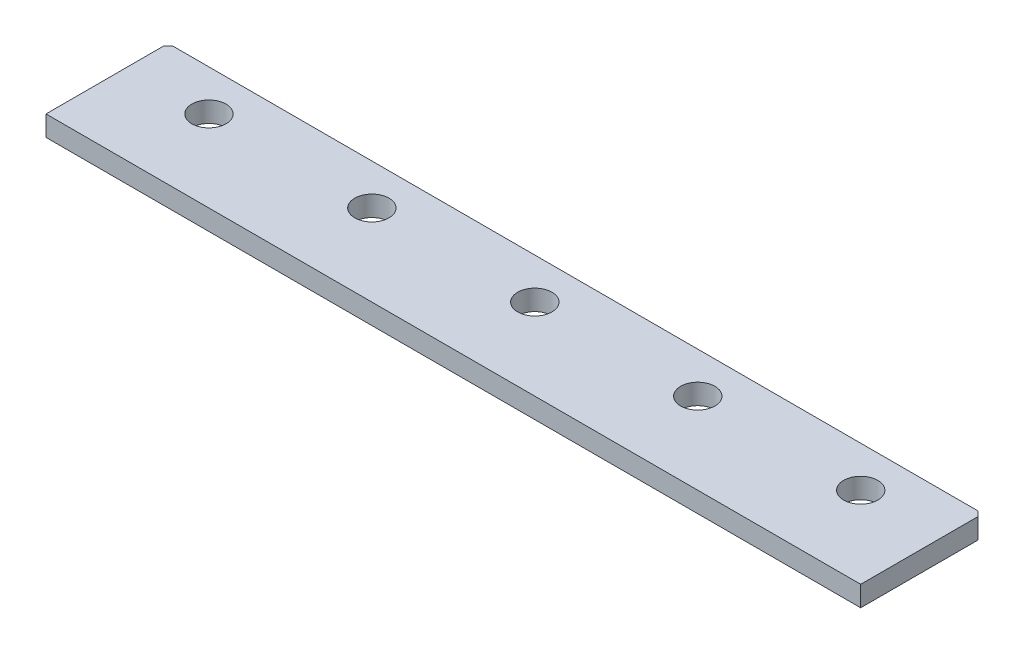
ISO-10303-21;
HEADER;
FILE_DESCRIPTION(('STEP AP214'),'2;1');
FILE_NAME('part.step','',(''),(''),'','','');
FILE_SCHEMA(('AUTOMOTIVE_DESIGN { 1 0 10303 214 1 1 1 1 }'));
ENDSEC;
DATA;
#1=APPLICATION_CONTEXT('core data for automotive mechanical design processes');
#2=APPLICATION_PROTOCOL_DEFINITION('international standard','automotive_design',2000,#1);
#3=PRODUCT_CONTEXT('',#1,'mechanical');
#4=PRODUCT('Part','Part','',(#3));
#5=PRODUCT_RELATED_PRODUCT_CATEGORY('part','',(#4));
#6=PRODUCT_DEFINITION_FORMATION('','',#4);
#7=PRODUCT_DEFINITION_CONTEXT('part definition',#1,'design');
#8=PRODUCT_DEFINITION('design','',#6,#7);
#9=PRODUCT_DEFINITION_SHAPE('','',#8);
#10=(LENGTH_UNIT() NAMED_UNIT(*) SI_UNIT(.MILLI.,.METRE.));
#11=(NAMED_UNIT(*) PLANE_ANGLE_UNIT() SI_UNIT($,.RADIAN.));
#12=(NAMED_UNIT(*) SI_UNIT($,.STERADIAN.) SOLID_ANGLE_UNIT());
#13=UNCERTAINTY_MEASURE_WITH_UNIT(LENGTH_MEASURE(1.E-05),#10,'distance_accuracy_value','');
#14=(GEOMETRIC_REPRESENTATION_CONTEXT(3) GLOBAL_UNCERTAINTY_ASSIGNED_CONTEXT((#13)) GLOBAL_UNIT_ASSIGNED_CONTEXT((#10,
#11,#12)) REPRESENTATION_CONTEXT('',''));
#15=CARTESIAN_POINT('',(0.,0.,0.));
#16=DIRECTION('',(0.,0.,1.));
#17=DIRECTION('',(1.,0.,0.));
#18=AXIS2_PLACEMENT_3D('',#15,#16,#17);
#19=CARTESIAN_POINT('',(-63.5,3.175,9.52500000000001));
#20=DIRECTION('',(1.,0.,0.));
#21=DIRECTION('',(0.,0.,-1.));
#22=AXIS2_PLACEMENT_3D('',#19,#20,#21);
#23=PLANE('',#22);
#24=DIRECTION('',(0.,0.,1.));
#25=VECTOR('',#24,1.);
#26=CARTESIAN_POINT('',(-63.5,3.175,9.52500000000001));
#27=LINE('',#26,#25);
#28=CARTESIAN_POINT('',(-63.5,3.175,-8.76299999999999));
#29=VERTEX_POINT('',#28);
#30=CARTESIAN_POINT('',(-63.5,3.175,9.52500000000001));
#31=VERTEX_POINT('',#30);
#32=EDGE_CURVE('E106',#29,#31,#27,.T.);
#33=ORIENTED_EDGE('',*,*,#32,.F.);
#34=DIRECTION('',(0.,1.,0.));
#35=VECTOR('',#34,1.);
#36=CARTESIAN_POINT('',(-63.5,0.,-8.76299999999999));
#37=LINE('',#36,#35);
#38=CARTESIAN_POINT('',(-63.5,0.,-8.76299999999999));
#39=VERTEX_POINT('',#38);
#40=EDGE_CURVE('E92',#39,#29,#37,.T.);
#41=ORIENTED_EDGE('',*,*,#40,.F.);
#42=DIRECTION('',(0.,0.,1.));
#43=VECTOR('',#42,1.);
#44=CARTESIAN_POINT('',(-63.5,0.,9.52500000000001));
#45=LINE('',#44,#43);
#46=CARTESIAN_POINT('',(-63.5,0.,9.52500000000001));
#47=VERTEX_POINT('',#46);
#48=EDGE_CURVE('E104',#39,#47,#45,.T.);
#49=ORIENTED_EDGE('',*,*,#48,.T.);
#50=DIRECTION('',(0.,-1.,0.));
#51=VECTOR('',#50,1.);
#52=CARTESIAN_POINT('',(-63.5,3.175,9.52500000000001));
#53=LINE('',#52,#51);
#54=EDGE_CURVE('E11',#31,#47,#53,.T.);
#55=ORIENTED_EDGE('',*,*,#54,.F.);
#56=EDGE_LOOP('',(#33,#41,#49,#55));
#57=FACE_BOUND('',#56,.T.);
#58=ADVANCED_FACE('F39',(#57),#23,.F.);
#59=CARTESIAN_POINT('',(63.5,3.175,9.52499999999999));
#60=DIRECTION('',(0.,0.,-1.));
#61=DIRECTION('',(-1.,0.,0.));
#62=AXIS2_PLACEMENT_3D('',#59,#60,#61);
#63=PLANE('',#62);
#64=DIRECTION('',(1.,0.,0.));
#65=VECTOR('',#64,1.);
#66=CARTESIAN_POINT('',(63.5,0.,9.52499999999999));
#67=LINE('',#66,#65);
#68=CARTESIAN_POINT('',(63.5,0.,9.52499999999999));
#69=VERTEX_POINT('',#68);
#70=EDGE_CURVE('E111',#47,#69,#67,.T.);
#71=ORIENTED_EDGE('',*,*,#70,.T.);
#72=DIRECTION('',(0.,-1.,0.));
#73=VECTOR('',#72,1.);
#74=CARTESIAN_POINT('',(63.5,3.175,9.52499999999999));
#75=LINE('',#74,#73);
#76=CARTESIAN_POINT('',(63.5,3.175,9.52499999999999));
#77=VERTEX_POINT('',#76);
#78=EDGE_CURVE('E47',#77,#69,#75,.T.);
#79=ORIENTED_EDGE('',*,*,#78,.F.);
#80=DIRECTION('',(1.,0.,0.));
#81=VECTOR('',#80,1.);
#82=CARTESIAN_POINT('',(63.5,3.175,9.52499999999999));
#83=LINE('',#82,#81);
#84=EDGE_CURVE('E144',#31,#77,#83,.T.);
#85=ORIENTED_EDGE('',*,*,#84,.F.);
#86=ORIENTED_EDGE('',*,*,#54,.T.);
#87=EDGE_LOOP('',(#71,#79,#85,#86));
#88=FACE_BOUND('',#87,.T.);
#89=ADVANCED_FACE('F204',(#88),#63,.F.);
#90=CARTESIAN_POINT('',(63.5,3.175,9.52499999999999));
#91=DIRECTION('',(-1.,0.,0.));
#92=DIRECTION('',(0.,0.,1.));
#93=AXIS2_PLACEMENT_3D('',#90,#91,#92);
#94=PLANE('',#93);
#95=DIRECTION('',(0.,0.,-1.));
#96=VECTOR('',#95,1.);
#97=CARTESIAN_POINT('',(63.5,0.,9.52499999999999));
#98=LINE('',#97,#96);
#99=CARTESIAN_POINT('',(63.5,0.,-8.76299999999999));
#100=VERTEX_POINT('',#99);
#101=EDGE_CURVE('E117',#69,#100,#98,.T.);
#102=ORIENTED_EDGE('',*,*,#101,.T.);
#103=DIRECTION('',(0.,1.,0.));
#104=VECTOR('',#103,1.);
#105=CARTESIAN_POINT('',(63.5,0.,-8.76299999999999));
#106=LINE('',#105,#104);
#107=CARTESIAN_POINT('',(63.5,3.175,-8.76299999999999));
#108=VERTEX_POINT('',#107);
#109=EDGE_CURVE('E54',#100,#108,#106,.T.);
#110=ORIENTED_EDGE('',*,*,#109,.T.);
#111=DIRECTION('',(0.,0.,-1.));
#112=VECTOR('',#111,1.);
#113=CARTESIAN_POINT('',(63.5,3.175,9.52499999999999));
#114=LINE('',#113,#112);
#115=EDGE_CURVE('E138',#77,#108,#114,.T.);
#116=ORIENTED_EDGE('',*,*,#115,.F.);
#117=ORIENTED_EDGE('',*,*,#78,.T.);
#118=EDGE_LOOP('',(#102,#110,#116,#117));
#119=FACE_BOUND('',#118,.T.);
#120=ADVANCED_FACE('F202',(#119),#94,.F.);
#121=CARTESIAN_POINT('',(63.5,3.175,-9.52500000000001));
#122=DIRECTION('',(0.,0.,1.));
#123=DIRECTION('',(1.,0.,0.));
#124=AXIS2_PLACEMENT_3D('',#121,#122,#123);
#125=PLANE('',#124);
#126=DIRECTION('',(-1.,0.,0.));
#127=VECTOR('',#126,1.);
#128=CARTESIAN_POINT('',(63.5,0.,-9.52500000000001));
#129=LINE('',#128,#127);
#130=CARTESIAN_POINT('',(62.7379999999999,0.,-9.52500000000001));
#131=VERTEX_POINT('',#130);
#132=CARTESIAN_POINT('',(-62.738,0.,-9.525));
#133=VERTEX_POINT('',#132);
#134=EDGE_CURVE('E129',#131,#133,#129,.T.);
#135=ORIENTED_EDGE('',*,*,#134,.T.);
#136=DIRECTION('',(0.,1.,0.));
#137=VECTOR('',#136,1.);
#138=CARTESIAN_POINT('',(-62.738,0.,-9.52499999999999));
#139=LINE('',#138,#137);
#140=CARTESIAN_POINT('',(-62.738,3.175,-9.52499999999999));
#141=VERTEX_POINT('',#140);
#142=EDGE_CURVE('E62',#133,#141,#139,.T.);
#143=ORIENTED_EDGE('',*,*,#142,.T.);
#144=DIRECTION('',(-1.,0.,0.));
#145=VECTOR('',#144,1.);
#146=CARTESIAN_POINT('',(63.5,3.175,-9.52500000000001));
#147=LINE('',#146,#145);
#148=CARTESIAN_POINT('',(62.7379999999999,3.175,-9.52500000000001));
#149=VERTEX_POINT('',#148);
#150=EDGE_CURVE('E123',#149,#141,#147,.T.);
#151=ORIENTED_EDGE('',*,*,#150,.F.);
#152=DIRECTION('',(0.,1.,0.));
#153=VECTOR('',#152,1.);
#154=CARTESIAN_POINT('',(62.7379999999999,0.,-9.52500000000001));
#155=LINE('',#154,#153);
#156=EDGE_CURVE('E185',#131,#149,#155,.T.);
#157=ORIENTED_EDGE('',*,*,#156,.F.);
#158=EDGE_LOOP('',(#135,#143,#151,#157));
#159=FACE_BOUND('',#158,.T.);
#160=ADVANCED_FACE('F200',(#159),#125,.F.);
#161=CARTESIAN_POINT('',(0.,3.175,0.));
#162=DIRECTION('',(0.,1.,0.));
#163=DIRECTION('',(0.,0.,1.));
#164=AXIS2_PLACEMENT_3D('',#161,#162,#163);
#165=PLANE('',#164);
#166=DIRECTION('',(0.70710678118654,0.,-0.707106781186555));
#167=VECTOR('',#166,1.);
#168=CARTESIAN_POINT('',(-62.738,3.175,-9.52499999999999));
#169=LINE('',#168,#167);
#170=EDGE_CURVE('E99',#29,#141,#169,.T.);
#171=ORIENTED_EDGE('',*,*,#170,.F.);
#172=ORIENTED_EDGE('',*,*,#32,.T.);
#173=ORIENTED_EDGE('',*,*,#84,.T.);
#174=ORIENTED_EDGE('',*,*,#115,.T.);
#175=DIRECTION('',(0.707106781186564,0.,0.707106781186531));
#176=VECTOR('',#175,1.);
#177=CARTESIAN_POINT('',(63.5,3.175,-8.76299999999999));
#178=LINE('',#177,#176);
#179=EDGE_CURVE('E191',#149,#108,#178,.T.);
#180=ORIENTED_EDGE('',*,*,#179,.F.);
#181=ORIENTED_EDGE('',*,*,#150,.T.);
#182=EDGE_LOOP('',(#171,#172,#173,#174,#180,#181));
#183=FACE_BOUND('',#182,.T.);
#184=CARTESIAN_POINT('',(-50.8,3.175,-3.1749999999993));
#185=DIRECTION('',(0.,1.,0.));
#186=DIRECTION('',(0.,0.,1.));
#187=AXIS2_PLACEMENT_3D('',#184,#185,#186);
#188=CIRCLE('',#187,2.667);
#189=CARTESIAN_POINT('',(-50.8,3.175,-0.507999999999293));
#190=VERTEX_POINT('',#189);
#191=EDGE_CURVE('E120',#190,#190,#188,.T.);
#192=ORIENTED_EDGE('',*,*,#191,.F.);
#193=EDGE_LOOP('',(#192));
#194=FACE_BOUND('',#193,.T.);
#195=CARTESIAN_POINT('',(-25.4,3.175,-3.17499999999947));
#196=DIRECTION('',(0.,1.,0.));
#197=DIRECTION('',(0.,0.,1.));
#198=AXIS2_PLACEMENT_3D('',#195,#196,#197);
#199=CIRCLE('',#198,2.667);
#200=CARTESIAN_POINT('',(-25.4,3.175,-0.507999999999471));
#201=VERTEX_POINT('',#200);
#202=EDGE_CURVE('E174',#201,#201,#199,.T.);
#203=ORIENTED_EDGE('',*,*,#202,.F.);
#204=EDGE_LOOP('',(#203));
#205=FACE_BOUND('',#204,.T.);
#206=CARTESIAN_POINT('',(0.,3.175,-3.17499999999965));
#207=DIRECTION('',(0.,1.,0.));
#208=DIRECTION('',(0.,0.,1.));
#209=AXIS2_PLACEMENT_3D('',#206,#207,#208);
#210=CIRCLE('',#209,2.667);
#211=CARTESIAN_POINT('',(0.,3.175,-0.507999999999648));
#212=VERTEX_POINT('',#211);
#213=EDGE_CURVE('E166',#212,#212,#210,.T.);
#214=ORIENTED_EDGE('',*,*,#213,.F.);
#215=EDGE_LOOP('',(#214));
#216=FACE_BOUND('',#215,.T.);
#217=CARTESIAN_POINT('',(25.4,3.175,-3.17499999999983));
#218=DIRECTION('',(0.,1.,0.));
#219=DIRECTION('',(0.,0.,1.));
#220=AXIS2_PLACEMENT_3D('',#217,#218,#219);
#221=CIRCLE('',#220,2.667);
#222=CARTESIAN_POINT('',(25.4,3.175,-0.507999999999825));
#223=VERTEX_POINT('',#222);
#224=EDGE_CURVE('E158',#223,#223,#221,.T.);
#225=ORIENTED_EDGE('',*,*,#224,.F.);
#226=EDGE_LOOP('',(#225));
#227=FACE_BOUND('',#226,.T.);
#228=CARTESIAN_POINT('',(50.8,3.175,-3.17500000000001));
#229=DIRECTION('',(0.,1.,0.));
#230=DIRECTION('',(0.,0.,1.));
#231=AXIS2_PLACEMENT_3D('',#228,#229,#230);
#232=CIRCLE('',#231,2.667);
#233=CARTESIAN_POINT('',(50.8,3.175,-0.508000000000003));
#234=VERTEX_POINT('',#233);
#235=EDGE_CURVE('E150',#234,#234,#232,.T.);
#236=ORIENTED_EDGE('',*,*,#235,.F.);
#237=EDGE_LOOP('',(#236));
#238=FACE_BOUND('',#237,.T.);
#239=ADVANCED_FACE('F210',(#183,#194,#205,#216,#227,#238),#165,.T.);
#240=CARTESIAN_POINT('',(0.,0.,0.));
#241=DIRECTION('',(0.,1.,0.));
#242=DIRECTION('',(0.,0.,1.));
#243=AXIS2_PLACEMENT_3D('',#240,#241,#242);
#244=PLANE('',#243);
#245=CARTESIAN_POINT('',(-50.8,0.,-3.1749999999993));
#246=DIRECTION('',(0.,1.,0.));
#247=DIRECTION('',(0.,0.,1.));
#248=AXIS2_PLACEMENT_3D('',#245,#246,#247);
#249=CIRCLE('',#248,2.667);
#250=CARTESIAN_POINT('',(-50.8,0.,-0.507999999999293));
#251=VERTEX_POINT('',#250);
#252=EDGE_CURVE('E113',#251,#251,#249,.T.);
#253=ORIENTED_EDGE('',*,*,#252,.T.);
#254=EDGE_LOOP('',(#253));
#255=FACE_BOUND('',#254,.T.);
#256=CARTESIAN_POINT('',(-25.4,0.,-3.17499999999947));
#257=DIRECTION('',(0.,1.,0.));
#258=DIRECTION('',(0.,0.,1.));
#259=AXIS2_PLACEMENT_3D('',#256,#257,#258);
#260=CIRCLE('',#259,2.667);
#261=CARTESIAN_POINT('',(-25.4,0.,-0.507999999999471));
#262=VERTEX_POINT('',#261);
#263=EDGE_CURVE('E178',#262,#262,#260,.T.);
#264=ORIENTED_EDGE('',*,*,#263,.T.);
#265=EDGE_LOOP('',(#264));
#266=FACE_BOUND('',#265,.T.);
#267=CARTESIAN_POINT('',(0.,0.,-3.17499999999965));
#268=DIRECTION('',(0.,1.,0.));
#269=DIRECTION('',(0.,0.,1.));
#270=AXIS2_PLACEMENT_3D('',#267,#268,#269);
#271=CIRCLE('',#270,2.667);
#272=CARTESIAN_POINT('',(0.,0.,-0.507999999999648));
#273=VERTEX_POINT('',#272);
#274=EDGE_CURVE('E170',#273,#273,#271,.T.);
#275=ORIENTED_EDGE('',*,*,#274,.T.);
#276=EDGE_LOOP('',(#275));
#277=FACE_BOUND('',#276,.T.);
#278=CARTESIAN_POINT('',(25.4,0.,-3.17499999999983));
#279=DIRECTION('',(0.,1.,0.));
#280=DIRECTION('',(0.,0.,1.));
#281=AXIS2_PLACEMENT_3D('',#278,#279,#280);
#282=CIRCLE('',#281,2.667);
#283=CARTESIAN_POINT('',(25.4,0.,-0.507999999999825));
#284=VERTEX_POINT('',#283);
#285=EDGE_CURVE('E162',#284,#284,#282,.T.);
#286=ORIENTED_EDGE('',*,*,#285,.T.);
#287=EDGE_LOOP('',(#286));
#288=FACE_BOUND('',#287,.T.);
#289=CARTESIAN_POINT('',(50.8,0.,-3.17500000000001));
#290=DIRECTION('',(0.,1.,0.));
#291=DIRECTION('',(0.,0.,1.));
#292=AXIS2_PLACEMENT_3D('',#289,#290,#291);
#293=CIRCLE('',#292,2.667);
#294=CARTESIAN_POINT('',(50.8,0.,-0.508000000000003));
#295=VERTEX_POINT('',#294);
#296=EDGE_CURVE('E154',#295,#295,#293,.T.);
#297=ORIENTED_EDGE('',*,*,#296,.T.);
#298=EDGE_LOOP('',(#297));
#299=FACE_BOUND('',#298,.T.);
#300=ORIENTED_EDGE('',*,*,#48,.F.);
#301=DIRECTION('',(0.70710678118654,0.,-0.707106781186555));
#302=VECTOR('',#301,1.);
#303=CARTESIAN_POINT('',(-62.738,0.,-9.52499999999999));
#304=LINE('',#303,#302);
#305=EDGE_CURVE('E89',#39,#133,#304,.T.);
#306=ORIENTED_EDGE('',*,*,#305,.T.);
#307=ORIENTED_EDGE('',*,*,#134,.F.);
#308=DIRECTION('',(0.707106781186564,0.,0.707106781186531));
#309=VECTOR('',#308,1.);
#310=CARTESIAN_POINT('',(63.5,0.,-8.76299999999999));
#311=LINE('',#310,#309);
#312=EDGE_CURVE('E188',#131,#100,#311,.T.);
#313=ORIENTED_EDGE('',*,*,#312,.T.);
#314=ORIENTED_EDGE('',*,*,#101,.F.);
#315=ORIENTED_EDGE('',*,*,#70,.F.);
#316=EDGE_LOOP('',(#300,#306,#307,#313,#314,#315));
#317=FACE_BOUND('',#316,.T.);
#318=ADVANCED_FACE('F109',(#255,#266,#277,#288,#299,#317),#244,.F.);
#319=CARTESIAN_POINT('',(50.8,0.,-3.17500000000001));
#320=DIRECTION('',(0.,1.,0.));
#321=DIRECTION('',(0.,0.,1.));
#322=AXIS2_PLACEMENT_3D('',#319,#320,#321);
#323=CYLINDRICAL_SURFACE('',#322,2.667);
#324=ORIENTED_EDGE('',*,*,#296,.F.);
#325=EDGE_LOOP('',(#324));
#326=FACE_BOUND('',#325,.T.);
#327=ORIENTED_EDGE('',*,*,#235,.T.);
#328=EDGE_LOOP('',(#327));
#329=FACE_BOUND('',#328,.T.);
#330=ADVANCED_FACE('F227',(#326,#329),#323,.F.);
#331=CARTESIAN_POINT('',(25.4,0.,-3.17499999999983));
#332=DIRECTION('',(0.,1.,0.));
#333=DIRECTION('',(0.,0.,1.));
#334=AXIS2_PLACEMENT_3D('',#331,#332,#333);
#335=CYLINDRICAL_SURFACE('',#334,2.667);
#336=ORIENTED_EDGE('',*,*,#285,.F.);
#337=EDGE_LOOP('',(#336));
#338=FACE_BOUND('',#337,.T.);
#339=ORIENTED_EDGE('',*,*,#224,.T.);
#340=EDGE_LOOP('',(#339));
#341=FACE_BOUND('',#340,.T.);
#342=ADVANCED_FACE('F232',(#338,#341),#335,.F.);
#343=CARTESIAN_POINT('',(0.,0.,-3.17499999999965));
#344=DIRECTION('',(0.,1.,0.));
#345=DIRECTION('',(0.,0.,1.));
#346=AXIS2_PLACEMENT_3D('',#343,#344,#345);
#347=CYLINDRICAL_SURFACE('',#346,2.667);
#348=ORIENTED_EDGE('',*,*,#274,.F.);
#349=EDGE_LOOP('',(#348));
#350=FACE_BOUND('',#349,.T.);
#351=ORIENTED_EDGE('',*,*,#213,.T.);
#352=EDGE_LOOP('',(#351));
#353=FACE_BOUND('',#352,.T.);
#354=ADVANCED_FACE('F244',(#350,#353),#347,.F.);
#355=CARTESIAN_POINT('',(-25.4,0.,-3.17499999999947));
#356=DIRECTION('',(0.,1.,0.));
#357=DIRECTION('',(0.,0.,1.));
#358=AXIS2_PLACEMENT_3D('',#355,#356,#357);
#359=CYLINDRICAL_SURFACE('',#358,2.667);
#360=ORIENTED_EDGE('',*,*,#263,.F.);
#361=EDGE_LOOP('',(#360));
#362=FACE_BOUND('',#361,.T.);
#363=ORIENTED_EDGE('',*,*,#202,.T.);
#364=EDGE_LOOP('',(#363));
#365=FACE_BOUND('',#364,.T.);
#366=ADVANCED_FACE('F254',(#362,#365),#359,.F.);
#367=CARTESIAN_POINT('',(-50.8,0.,-3.1749999999993));
#368=DIRECTION('',(0.,1.,0.));
#369=DIRECTION('',(0.,0.,1.));
#370=AXIS2_PLACEMENT_3D('',#367,#368,#369);
#371=CYLINDRICAL_SURFACE('',#370,2.667);
#372=ORIENTED_EDGE('',*,*,#252,.F.);
#373=EDGE_LOOP('',(#372));
#374=FACE_BOUND('',#373,.T.);
#375=ORIENTED_EDGE('',*,*,#191,.T.);
#376=EDGE_LOOP('',(#375));
#377=FACE_BOUND('',#376,.T.);
#378=ADVANCED_FACE('F263',(#374,#377),#371,.F.);
#379=CARTESIAN_POINT('',(63.5,0.,-8.76299999999999));
#380=DIRECTION('',(-0.707106781186531,0.,0.707106781186564));
#381=DIRECTION('',(0.707106781186564,0.,0.707106781186531));
#382=AXIS2_PLACEMENT_3D('',#379,#380,#381);
#383=PLANE('',#382);
#384=ORIENTED_EDGE('',*,*,#179,.T.);
#385=ORIENTED_EDGE('',*,*,#109,.F.);
#386=ORIENTED_EDGE('',*,*,#312,.F.);
#387=ORIENTED_EDGE('',*,*,#156,.T.);
#388=EDGE_LOOP('',(#384,#385,#386,#387));
#389=FACE_BOUND('',#388,.T.);
#390=ADVANCED_FACE('F272',(#389),#383,.F.);
#391=CARTESIAN_POINT('',(-62.738,0.,-9.52499999999999));
#392=DIRECTION('',(0.707106781186555,0.,0.70710678118654));
#393=DIRECTION('',(0.70710678118654,0.,-0.707106781186555));
#394=AXIS2_PLACEMENT_3D('',#391,#392,#393);
#395=PLANE('',#394);
#396=ORIENTED_EDGE('',*,*,#170,.T.);
#397=ORIENTED_EDGE('',*,*,#142,.F.);
#398=ORIENTED_EDGE('',*,*,#305,.F.);
#399=ORIENTED_EDGE('',*,*,#40,.T.);
#400=EDGE_LOOP('',(#396,#397,#398,#399));
#401=FACE_BOUND('',#400,.T.);
#402=ADVANCED_FACE('F91',(#401),#395,.F.);
#403=CLOSED_SHELL('',(#58,#89,#120,#160,#239,#318,#330,#342,#354,#366,#378,#390,#402));
#404=MANIFOLD_SOLID_BREP('B2',#403);
#405=ADVANCED_BREP_SHAPE_REPRESENTATION('',(#18,#404),#14);
#406=SHAPE_DEFINITION_REPRESENTATION(#9,#405);
ENDSEC;
END-ISO-10303-21;
